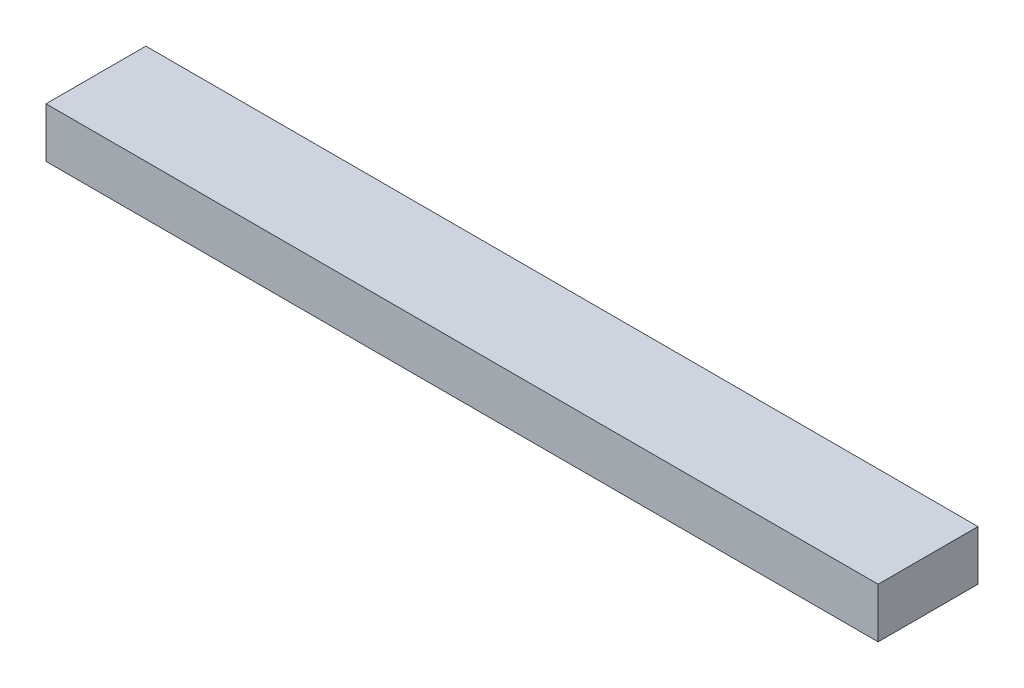
ISO-10303-21;
HEADER;
FILE_DESCRIPTION(('STEP AP214'),'2;1');
FILE_NAME('part.step','',(''),(''),'','','');
FILE_SCHEMA(('AUTOMOTIVE_DESIGN { 1 0 10303 214 1 1 1 1 }'));
ENDSEC;
DATA;
#1=APPLICATION_CONTEXT('core data for automotive mechanical design processes');
#2=APPLICATION_PROTOCOL_DEFINITION('international standard','automotive_design',2000,#1);
#3=PRODUCT_CONTEXT('',#1,'mechanical');
#4=PRODUCT('Part','Part','',(#3));
#5=PRODUCT_RELATED_PRODUCT_CATEGORY('part','',(#4));
#6=PRODUCT_DEFINITION_FORMATION('','',#4);
#7=PRODUCT_DEFINITION_CONTEXT('part definition',#1,'design');
#8=PRODUCT_DEFINITION('design','',#6,#7);
#9=PRODUCT_DEFINITION_SHAPE('','',#8);
#10=(LENGTH_UNIT() NAMED_UNIT(*) SI_UNIT(.MILLI.,.METRE.));
#11=(NAMED_UNIT(*) PLANE_ANGLE_UNIT() SI_UNIT($,.RADIAN.));
#12=(NAMED_UNIT(*) SI_UNIT($,.STERADIAN.) SOLID_ANGLE_UNIT());
#13=UNCERTAINTY_MEASURE_WITH_UNIT(LENGTH_MEASURE(1.E-05),#10,'distance_accuracy_value','');
#14=(GEOMETRIC_REPRESENTATION_CONTEXT(3) GLOBAL_UNCERTAINTY_ASSIGNED_CONTEXT((#13)) GLOBAL_UNIT_ASSIGNED_CONTEXT((#10,
#11,#12)) REPRESENTATION_CONTEXT('',''));
#15=CARTESIAN_POINT('',(0.,0.,0.));
#16=DIRECTION('',(0.,0.,1.));
#17=DIRECTION('',(1.,0.,0.));
#18=AXIS2_PLACEMENT_3D('',#15,#16,#17);
#19=CARTESIAN_POINT('',(250.,15.,0.));
#20=DIRECTION('',(0.,0.,-1.));
#21=DIRECTION('',(-1.,0.,0.));
#22=AXIS2_PLACEMENT_3D('',#19,#20,#21);
#23=PLANE('',#22);
#24=DIRECTION('',(1.,0.,0.));
#25=VECTOR('',#24,1.);
#26=CARTESIAN_POINT('',(250.,0.,0.));
#27=LINE('',#26,#25);
#28=CARTESIAN_POINT('',(0.,0.,0.));
#29=VERTEX_POINT('',#28);
#30=CARTESIAN_POINT('',(250.,0.,0.));
#31=VERTEX_POINT('',#30);
#32=EDGE_CURVE('E98',#29,#31,#27,.T.);
#33=ORIENTED_EDGE('',*,*,#32,.T.);
#34=DIRECTION('',(0.,-1.,0.));
#35=VECTOR('',#34,1.);
#36=CARTESIAN_POINT('',(250.,15.,0.));
#37=LINE('',#36,#35);
#38=CARTESIAN_POINT('',(250.,15.,0.));
#39=VERTEX_POINT('',#38);
#40=EDGE_CURVE('E11',#39,#31,#37,.T.);
#41=ORIENTED_EDGE('',*,*,#40,.F.);
#42=DIRECTION('',(1.,0.,0.));
#43=VECTOR('',#42,1.);
#44=CARTESIAN_POINT('',(250.,15.,0.));
#45=LINE('',#44,#43);
#46=CARTESIAN_POINT('',(0.,15.,0.));
#47=VERTEX_POINT('',#46);
#48=EDGE_CURVE('E86',#47,#39,#45,.T.);
#49=ORIENTED_EDGE('',*,*,#48,.F.);
#50=DIRECTION('',(0.,-1.,0.));
#51=VECTOR('',#50,1.);
#52=CARTESIAN_POINT('',(0.,15.,0.));
#53=LINE('',#52,#51);
#54=EDGE_CURVE('E94',#47,#29,#53,.T.);
#55=ORIENTED_EDGE('',*,*,#54,.T.);
#56=EDGE_LOOP('',(#33,#41,#49,#55));
#57=FACE_BOUND('',#56,.T.);
#58=ADVANCED_FACE('F35',(#57),#23,.F.);
#59=CARTESIAN_POINT('',(250.,15.,-30.));
#60=DIRECTION('',(-1.,0.,0.));
#61=DIRECTION('',(0.,0.,1.));
#62=AXIS2_PLACEMENT_3D('',#59,#60,#61);
#63=PLANE('',#62);
#64=DIRECTION('',(0.,0.,-1.));
#65=VECTOR('',#64,1.);
#66=CARTESIAN_POINT('',(250.,0.,-30.));
#67=LINE('',#66,#65);
#68=CARTESIAN_POINT('',(250.,0.,-30.));
#69=VERTEX_POINT('',#68);
#70=EDGE_CURVE('E90',#31,#69,#67,.T.);
#71=ORIENTED_EDGE('',*,*,#70,.T.);
#72=DIRECTION('',(0.,-1.,0.));
#73=VECTOR('',#72,1.);
#74=CARTESIAN_POINT('',(250.,15.,-30.));
#75=LINE('',#74,#73);
#76=CARTESIAN_POINT('',(250.,15.,-30.));
#77=VERTEX_POINT('',#76);
#78=EDGE_CURVE('E43',#77,#69,#75,.T.);
#79=ORIENTED_EDGE('',*,*,#78,.F.);
#80=DIRECTION('',(0.,0.,-1.));
#81=VECTOR('',#80,1.);
#82=CARTESIAN_POINT('',(250.,15.,-30.));
#83=LINE('',#82,#81);
#84=EDGE_CURVE('E81',#39,#77,#83,.T.);
#85=ORIENTED_EDGE('',*,*,#84,.F.);
#86=ORIENTED_EDGE('',*,*,#40,.T.);
#87=EDGE_LOOP('',(#71,#79,#85,#86));
#88=FACE_BOUND('',#87,.T.);
#89=ADVANCED_FACE('F89',(#88),#63,.F.);
#90=CARTESIAN_POINT('',(0.,15.,-30.));
#91=DIRECTION('',(0.,0.,1.));
#92=DIRECTION('',(1.,0.,0.));
#93=AXIS2_PLACEMENT_3D('',#90,#91,#92);
#94=PLANE('',#93);
#95=DIRECTION('',(-1.,0.,0.));
#96=VECTOR('',#95,1.);
#97=CARTESIAN_POINT('',(0.,0.,-30.));
#98=LINE('',#97,#96);
#99=CARTESIAN_POINT('',(0.,0.,-30.));
#100=VERTEX_POINT('',#99);
#101=EDGE_CURVE('E68',#69,#100,#98,.T.);
#102=ORIENTED_EDGE('',*,*,#101,.T.);
#103=DIRECTION('',(0.,-1.,0.));
#104=VECTOR('',#103,1.);
#105=CARTESIAN_POINT('',(0.,15.,-30.));
#106=LINE('',#105,#104);
#107=CARTESIAN_POINT('',(0.,15.,-30.));
#108=VERTEX_POINT('',#107);
#109=EDGE_CURVE('E91',#108,#100,#106,.T.);
#110=ORIENTED_EDGE('',*,*,#109,.F.);
#111=DIRECTION('',(-1.,0.,0.));
#112=VECTOR('',#111,1.);
#113=CARTESIAN_POINT('',(0.,15.,-30.));
#114=LINE('',#113,#112);
#115=EDGE_CURVE('E84',#77,#108,#114,.T.);
#116=ORIENTED_EDGE('',*,*,#115,.F.);
#117=ORIENTED_EDGE('',*,*,#78,.T.);
#118=EDGE_LOOP('',(#102,#110,#116,#117));
#119=FACE_BOUND('',#118,.T.);
#120=ADVANCED_FACE('F92',(#119),#94,.F.);
#121=CARTESIAN_POINT('',(0.,15.,0.));
#122=DIRECTION('',(1.,0.,0.));
#123=DIRECTION('',(0.,0.,-1.));
#124=AXIS2_PLACEMENT_3D('',#121,#122,#123);
#125=PLANE('',#124);
#126=DIRECTION('',(0.,0.,1.));
#127=VECTOR('',#126,1.);
#128=CARTESIAN_POINT('',(0.,0.,0.));
#129=LINE('',#128,#127);
#130=EDGE_CURVE('E74',#100,#29,#129,.T.);
#131=ORIENTED_EDGE('',*,*,#130,.T.);
#132=ORIENTED_EDGE('',*,*,#54,.F.);
#133=DIRECTION('',(0.,0.,1.));
#134=VECTOR('',#133,1.);
#135=CARTESIAN_POINT('',(0.,15.,0.));
#136=LINE('',#135,#134);
#137=EDGE_CURVE('E51',#108,#47,#136,.T.);
#138=ORIENTED_EDGE('',*,*,#137,.F.);
#139=ORIENTED_EDGE('',*,*,#109,.T.);
#140=EDGE_LOOP('',(#131,#132,#138,#139));
#141=FACE_BOUND('',#140,.T.);
#142=ADVANCED_FACE('F105',(#141),#125,.F.);
#143=CARTESIAN_POINT('',(0.,15.,0.));
#144=DIRECTION('',(0.,-1.,0.));
#145=DIRECTION('',(0.,0.,-1.));
#146=AXIS2_PLACEMENT_3D('',#143,#144,#145);
#147=PLANE('',#146);
#148=ORIENTED_EDGE('',*,*,#48,.T.);
#149=ORIENTED_EDGE('',*,*,#84,.T.);
#150=ORIENTED_EDGE('',*,*,#115,.T.);
#151=ORIENTED_EDGE('',*,*,#137,.T.);
#152=EDGE_LOOP('',(#148,#149,#150,#151));
#153=FACE_BOUND('',#152,.T.);
#154=ADVANCED_FACE('F82',(#153),#147,.F.);
#155=CARTESIAN_POINT('',(0.,0.,0.));
#156=DIRECTION('',(0.,-1.,0.));
#157=DIRECTION('',(0.,0.,-1.));
#158=AXIS2_PLACEMENT_3D('',#155,#156,#157);
#159=PLANE('',#158);
#160=ORIENTED_EDGE('',*,*,#32,.F.);
#161=ORIENTED_EDGE('',*,*,#130,.F.);
#162=ORIENTED_EDGE('',*,*,#101,.F.);
#163=ORIENTED_EDGE('',*,*,#70,.F.);
#164=EDGE_LOOP('',(#160,#161,#162,#163));
#165=FACE_BOUND('',#164,.T.);
#166=ADVANCED_FACE('F108',(#165),#159,.T.);
#167=CLOSED_SHELL('',(#58,#89,#120,#142,#154,#166));
#168=MANIFOLD_SOLID_BREP('B2',#167);
#169=ADVANCED_BREP_SHAPE_REPRESENTATION('',(#18,#168),#14);
#170=SHAPE_DEFINITION_REPRESENTATION(#9,#169);
ENDSEC;
END-ISO-10303-21;
